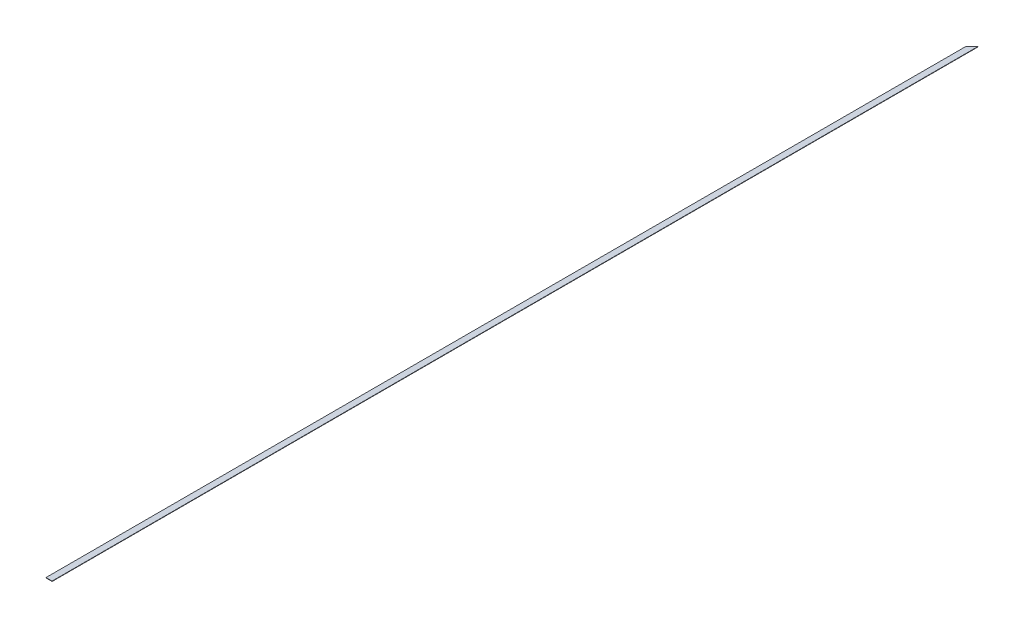
ISO-10303-21;
HEADER;
FILE_DESCRIPTION(('STEP AP214'),'2;1');
FILE_NAME('part.step','',(''),(''),'','','');
FILE_SCHEMA(('AUTOMOTIVE_DESIGN { 1 0 10303 214 1 1 1 1 }'));
ENDSEC;
DATA;
#1=APPLICATION_CONTEXT('core data for automotive mechanical design processes');
#2=APPLICATION_PROTOCOL_DEFINITION('international standard','automotive_design',2000,#1);
#3=PRODUCT_CONTEXT('',#1,'mechanical');
#4=PRODUCT('Part','Part','',(#3));
#5=PRODUCT_RELATED_PRODUCT_CATEGORY('part','',(#4));
#6=PRODUCT_DEFINITION_FORMATION('','',#4);
#7=PRODUCT_DEFINITION_CONTEXT('part definition',#1,'design');
#8=PRODUCT_DEFINITION('design','',#6,#7);
#9=PRODUCT_DEFINITION_SHAPE('','',#8);
#10=(LENGTH_UNIT() NAMED_UNIT(*) SI_UNIT(.MILLI.,.METRE.));
#11=(NAMED_UNIT(*) PLANE_ANGLE_UNIT() SI_UNIT($,.RADIAN.));
#12=(NAMED_UNIT(*) SI_UNIT($,.STERADIAN.) SOLID_ANGLE_UNIT());
#13=UNCERTAINTY_MEASURE_WITH_UNIT(LENGTH_MEASURE(1.E-05),#10,'distance_accuracy_value','');
#14=(GEOMETRIC_REPRESENTATION_CONTEXT(3) GLOBAL_UNCERTAINTY_ASSIGNED_CONTEXT((#13)) GLOBAL_UNIT_ASSIGNED_CONTEXT((#10,
#11,#12)) REPRESENTATION_CONTEXT('',''));
#15=CARTESIAN_POINT('',(0.,0.,0.));
#16=DIRECTION('',(0.,0.,1.));
#17=DIRECTION('',(1.,0.,0.));
#18=AXIS2_PLACEMENT_3D('',#15,#16,#17);
#19=CARTESIAN_POINT('',(25.4841059602644,3.175,-3860.84205298013));
#20=DIRECTION('',(-1.,0.,0.));
#21=DIRECTION('',(0.,0.,1.));
#22=AXIS2_PLACEMENT_3D('',#19,#20,#21);
#23=PLANE('',#22);
#24=DIRECTION('',(0.,0.,-1.));
#25=VECTOR('',#24,1.);
#26=CARTESIAN_POINT('',(25.4841059602644,0.,-3860.84205298013));
#27=LINE('',#26,#25);
#28=CARTESIAN_POINT('',(25.4841059602654,0.,3835.35794701987));
#29=VERTEX_POINT('',#28);
#30=CARTESIAN_POINT('',(25.4841059602644,0.,-3860.84205298013));
#31=VERTEX_POINT('',#30);
#32=EDGE_CURVE('E95',#29,#31,#27,.T.);
#33=ORIENTED_EDGE('',*,*,#32,.T.);
#34=DIRECTION('',(0.,-1.,0.));
#35=VECTOR('',#34,1.);
#36=CARTESIAN_POINT('',(25.4841059602644,3.175,-3860.84205298013));
#37=LINE('',#36,#35);
#38=CARTESIAN_POINT('',(25.4841059602644,3.175,-3860.84205298013));
#39=VERTEX_POINT('',#38);
#40=EDGE_CURVE('E11',#39,#31,#37,.T.);
#41=ORIENTED_EDGE('',*,*,#40,.F.);
#42=DIRECTION('',(0.,0.,-1.));
#43=VECTOR('',#42,1.);
#44=CARTESIAN_POINT('',(25.4841059602644,3.175,-3860.84205298013));
#45=LINE('',#44,#43);
#46=CARTESIAN_POINT('',(25.4841059602654,3.175,3835.35794701987));
#47=VERTEX_POINT('',#46);
#48=EDGE_CURVE('E83',#47,#39,#45,.T.);
#49=ORIENTED_EDGE('',*,*,#48,.F.);
#50=DIRECTION('',(0.,-1.,0.));
#51=VECTOR('',#50,1.);
#52=CARTESIAN_POINT('',(25.4841059602654,3.175,3835.35794701987));
#53=LINE('',#52,#51);
#54=EDGE_CURVE('E91',#47,#29,#53,.T.);
#55=ORIENTED_EDGE('',*,*,#54,.T.);
#56=EDGE_LOOP('',(#33,#41,#49,#55));
#57=FACE_BOUND('',#56,.T.);
#58=ADVANCED_FACE('F32',(#57),#23,.F.);
#59=CARTESIAN_POINT('',(-25.3158940397356,3.175,-3810.04205298013));
#60=DIRECTION('',(0.707106781186552,0.,0.707106781186543));
#61=DIRECTION('',(0.707106781186543,0.,-0.707106781186552));
#62=AXIS2_PLACEMENT_3D('',#59,#60,#61);
#63=PLANE('',#62);
#64=DIRECTION('',(-0.707106781186543,0.,0.707106781186552));
#65=VECTOR('',#64,1.);
#66=CARTESIAN_POINT('',(-25.3158940397356,0.,-3810.04205298013));
#67=LINE('',#66,#65);
#68=CARTESIAN_POINT('',(-25.3158940397356,0.,-3810.04205298013));
#69=VERTEX_POINT('',#68);
#70=EDGE_CURVE('E87',#31,#69,#67,.T.);
#71=ORIENTED_EDGE('',*,*,#70,.T.);
#72=DIRECTION('',(0.,-1.,0.));
#73=VECTOR('',#72,1.);
#74=CARTESIAN_POINT('',(-25.3158940397356,3.175,-3810.04205298013));
#75=LINE('',#74,#73);
#76=CARTESIAN_POINT('',(-25.3158940397356,3.175,-3810.04205298013));
#77=VERTEX_POINT('',#76);
#78=EDGE_CURVE('E40',#77,#69,#75,.T.);
#79=ORIENTED_EDGE('',*,*,#78,.F.);
#80=DIRECTION('',(-0.707106781186543,0.,0.707106781186552));
#81=VECTOR('',#80,1.);
#82=CARTESIAN_POINT('',(-25.3158940397356,3.175,-3810.04205298013));
#83=LINE('',#82,#81);
#84=EDGE_CURVE('E78',#39,#77,#83,.T.);
#85=ORIENTED_EDGE('',*,*,#84,.F.);
#86=ORIENTED_EDGE('',*,*,#40,.T.);
#87=EDGE_LOOP('',(#71,#79,#85,#86));
#88=FACE_BOUND('',#87,.T.);
#89=ADVANCED_FACE('F86',(#88),#63,.F.);
#90=CARTESIAN_POINT('',(-25.3158940397356,3.175,-3810.04205298013));
#91=DIRECTION('',(1.,0.,0.));
#92=DIRECTION('',(0.,0.,-1.));
#93=AXIS2_PLACEMENT_3D('',#90,#91,#92);
#94=PLANE('',#93);
#95=DIRECTION('',(0.,0.,1.));
#96=VECTOR('',#95,1.);
#97=CARTESIAN_POINT('',(-25.3158940397356,0.,-3810.04205298013));
#98=LINE('',#97,#96);
#99=CARTESIAN_POINT('',(-25.3158940397346,0.,3835.35794701987));
#100=VERTEX_POINT('',#99);
#101=EDGE_CURVE('E65',#69,#100,#98,.T.);
#102=ORIENTED_EDGE('',*,*,#101,.T.);
#103=DIRECTION('',(0.,-1.,0.));
#104=VECTOR('',#103,1.);
#105=CARTESIAN_POINT('',(-25.3158940397346,3.175,3835.35794701987));
#106=LINE('',#105,#104);
#107=CARTESIAN_POINT('',(-25.3158940397346,3.175,3835.35794701987));
#108=VERTEX_POINT('',#107);
#109=EDGE_CURVE('E88',#108,#100,#106,.T.);
#110=ORIENTED_EDGE('',*,*,#109,.F.);
#111=DIRECTION('',(0.,0.,1.));
#112=VECTOR('',#111,1.);
#113=CARTESIAN_POINT('',(-25.3158940397356,3.175,-3810.04205298013));
#114=LINE('',#113,#112);
#115=EDGE_CURVE('E81',#77,#108,#114,.T.);
#116=ORIENTED_EDGE('',*,*,#115,.F.);
#117=ORIENTED_EDGE('',*,*,#78,.T.);
#118=EDGE_LOOP('',(#102,#110,#116,#117));
#119=FACE_BOUND('',#118,.T.);
#120=ADVANCED_FACE('F89',(#119),#94,.F.);
#121=CARTESIAN_POINT('',(-25.3158940397346,3.175,3835.35794701987));
#122=DIRECTION('',(0.,0.,-1.));
#123=DIRECTION('',(-1.,0.,0.));
#124=AXIS2_PLACEMENT_3D('',#121,#122,#123);
#125=PLANE('',#124);
#126=DIRECTION('',(1.,0.,0.));
#127=VECTOR('',#126,1.);
#128=CARTESIAN_POINT('',(-25.3158940397346,0.,3835.35794701987));
#129=LINE('',#128,#127);
#130=EDGE_CURVE('E71',#100,#29,#129,.T.);
#131=ORIENTED_EDGE('',*,*,#130,.T.);
#132=ORIENTED_EDGE('',*,*,#54,.F.);
#133=DIRECTION('',(1.,0.,0.));
#134=VECTOR('',#133,1.);
#135=CARTESIAN_POINT('',(-25.3158940397346,3.175,3835.35794701987));
#136=LINE('',#135,#134);
#137=EDGE_CURVE('E48',#108,#47,#136,.T.);
#138=ORIENTED_EDGE('',*,*,#137,.F.);
#139=ORIENTED_EDGE('',*,*,#109,.T.);
#140=EDGE_LOOP('',(#131,#132,#138,#139));
#141=FACE_BOUND('',#140,.T.);
#142=ADVANCED_FACE('F102',(#141),#125,.F.);
#143=CARTESIAN_POINT('',(0.,3.175,0.));
#144=DIRECTION('',(0.,1.,0.));
#145=DIRECTION('',(0.,0.,1.));
#146=AXIS2_PLACEMENT_3D('',#143,#144,#145);
#147=PLANE('',#146);
#148=ORIENTED_EDGE('',*,*,#48,.T.);
#149=ORIENTED_EDGE('',*,*,#84,.T.);
#150=ORIENTED_EDGE('',*,*,#115,.T.);
#151=ORIENTED_EDGE('',*,*,#137,.T.);
#152=EDGE_LOOP('',(#148,#149,#150,#151));
#153=FACE_BOUND('',#152,.T.);
#154=ADVANCED_FACE('F79',(#153),#147,.T.);
#155=CARTESIAN_POINT('',(0.,0.,0.));
#156=DIRECTION('',(0.,1.,0.));
#157=DIRECTION('',(0.,0.,1.));
#158=AXIS2_PLACEMENT_3D('',#155,#156,#157);
#159=PLANE('',#158);
#160=ORIENTED_EDGE('',*,*,#32,.F.);
#161=ORIENTED_EDGE('',*,*,#130,.F.);
#162=ORIENTED_EDGE('',*,*,#101,.F.);
#163=ORIENTED_EDGE('',*,*,#70,.F.);
#164=EDGE_LOOP('',(#160,#161,#162,#163));
#165=FACE_BOUND('',#164,.T.);
#166=ADVANCED_FACE('F105',(#165),#159,.F.);
#167=CLOSED_SHELL('',(#58,#89,#120,#142,#154,#166));
#168=MANIFOLD_SOLID_BREP('B2',#167);
#169=ADVANCED_BREP_SHAPE_REPRESENTATION('',(#18,#168),#14);
#170=SHAPE_DEFINITION_REPRESENTATION(#9,#169);
ENDSEC;
END-ISO-10303-21;
